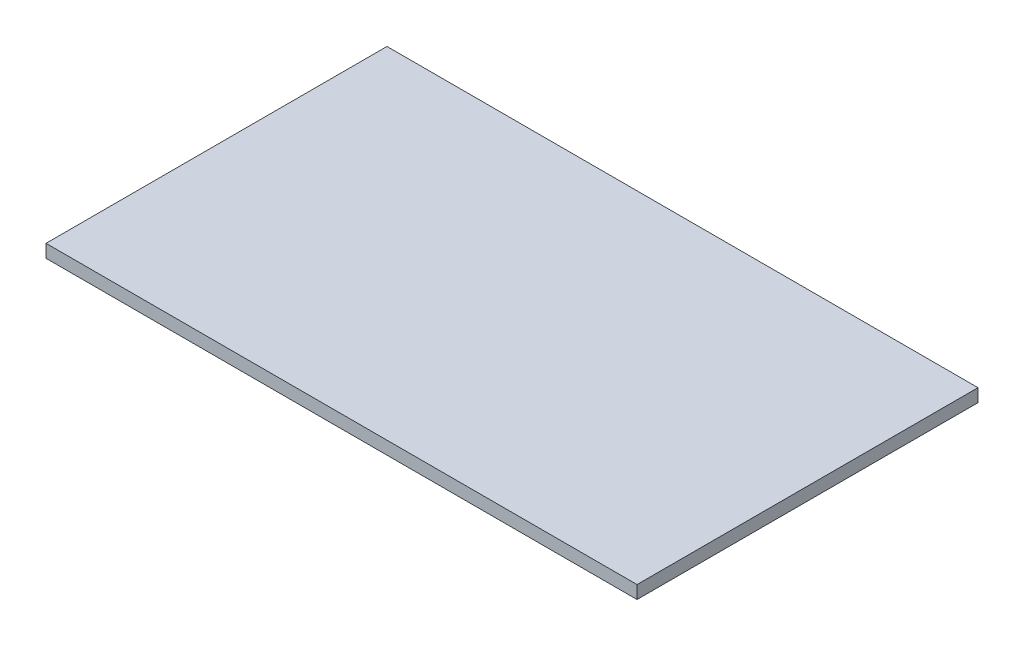
ISO-10303-21;
HEADER;
FILE_DESCRIPTION(('STEP AP214'),'2;1');
FILE_NAME('part.step','',(''),(''),'','','');
FILE_SCHEMA(('AUTOMOTIVE_DESIGN { 1 0 10303 214 1 1 1 1 }'));
ENDSEC;
DATA;
#1=APPLICATION_CONTEXT('core data for automotive mechanical design processes');
#2=APPLICATION_PROTOCOL_DEFINITION('international standard','automotive_design',2000,#1);
#3=PRODUCT_CONTEXT('',#1,'mechanical');
#4=PRODUCT('Part','Part','',(#3));
#5=PRODUCT_RELATED_PRODUCT_CATEGORY('part','',(#4));
#6=PRODUCT_DEFINITION_FORMATION('','',#4);
#7=PRODUCT_DEFINITION_CONTEXT('part definition',#1,'design');
#8=PRODUCT_DEFINITION('design','',#6,#7);
#9=PRODUCT_DEFINITION_SHAPE('','',#8);
#10=(LENGTH_UNIT() NAMED_UNIT(*) SI_UNIT(.MILLI.,.METRE.));
#11=(NAMED_UNIT(*) PLANE_ANGLE_UNIT() SI_UNIT($,.RADIAN.));
#12=(NAMED_UNIT(*) SI_UNIT($,.STERADIAN.) SOLID_ANGLE_UNIT());
#13=UNCERTAINTY_MEASURE_WITH_UNIT(LENGTH_MEASURE(1.E-05),#10,'distance_accuracy_value','');
#14=(GEOMETRIC_REPRESENTATION_CONTEXT(3) GLOBAL_UNCERTAINTY_ASSIGNED_CONTEXT((#13)) GLOBAL_UNIT_ASSIGNED_CONTEXT((#10,
#11,#12)) REPRESENTATION_CONTEXT('',''));
#15=CARTESIAN_POINT('',(0.,0.,0.));
#16=DIRECTION('',(0.,0.,1.));
#17=DIRECTION('',(1.,0.,0.));
#18=AXIS2_PLACEMENT_3D('',#15,#16,#17);
#19=CARTESIAN_POINT('',(0.,5.715,0.));
#20=DIRECTION('',(1.,0.,0.));
#21=DIRECTION('',(0.,0.,-1.));
#22=AXIS2_PLACEMENT_3D('',#19,#20,#21);
#23=PLANE('',#22);
#24=DIRECTION('',(0.,0.,1.));
#25=VECTOR('',#24,1.);
#26=CARTESIAN_POINT('',(0.,0.,0.));
#27=LINE('',#26,#25);
#28=CARTESIAN_POINT('',(0.,0.,-150.));
#29=VERTEX_POINT('',#28);
#30=CARTESIAN_POINT('',(0.,0.,0.));
#31=VERTEX_POINT('',#30);
#32=EDGE_CURVE('E97',#29,#31,#27,.T.);
#33=ORIENTED_EDGE('',*,*,#32,.T.);
#34=DIRECTION('',(0.,-1.,0.));
#35=VECTOR('',#34,1.);
#36=CARTESIAN_POINT('',(0.,5.715,0.));
#37=LINE('',#36,#35);
#38=CARTESIAN_POINT('',(0.,5.715,0.));
#39=VERTEX_POINT('',#38);
#40=EDGE_CURVE('E11',#39,#31,#37,.T.);
#41=ORIENTED_EDGE('',*,*,#40,.F.);
#42=DIRECTION('',(0.,0.,1.));
#43=VECTOR('',#42,1.);
#44=CARTESIAN_POINT('',(0.,5.715,0.));
#45=LINE('',#44,#43);
#46=CARTESIAN_POINT('',(0.,5.715,-150.));
#47=VERTEX_POINT('',#46);
#48=EDGE_CURVE('E85',#47,#39,#45,.T.);
#49=ORIENTED_EDGE('',*,*,#48,.F.);
#50=DIRECTION('',(0.,-1.,0.));
#51=VECTOR('',#50,1.);
#52=CARTESIAN_POINT('',(0.,5.715,-150.));
#53=LINE('',#52,#51);
#54=EDGE_CURVE('E93',#47,#29,#53,.T.);
#55=ORIENTED_EDGE('',*,*,#54,.T.);
#56=EDGE_LOOP('',(#33,#41,#49,#55));
#57=FACE_BOUND('',#56,.T.);
#58=ADVANCED_FACE('F34',(#57),#23,.F.);
#59=CARTESIAN_POINT('',(0.,5.715,0.));
#60=DIRECTION('',(0.,0.,-1.));
#61=DIRECTION('',(-1.,0.,0.));
#62=AXIS2_PLACEMENT_3D('',#59,#60,#61);
#63=PLANE('',#62);
#64=DIRECTION('',(1.,0.,0.));
#65=VECTOR('',#64,1.);
#66=CARTESIAN_POINT('',(0.,0.,0.));
#67=LINE('',#66,#65);
#68=CARTESIAN_POINT('',(260.,0.,0.));
#69=VERTEX_POINT('',#68);
#70=EDGE_CURVE('E89',#31,#69,#67,.T.);
#71=ORIENTED_EDGE('',*,*,#70,.T.);
#72=DIRECTION('',(0.,-1.,0.));
#73=VECTOR('',#72,1.);
#74=CARTESIAN_POINT('',(260.,5.715,0.));
#75=LINE('',#74,#73);
#76=CARTESIAN_POINT('',(260.,5.715,0.));
#77=VERTEX_POINT('',#76);
#78=EDGE_CURVE('E42',#77,#69,#75,.T.);
#79=ORIENTED_EDGE('',*,*,#78,.F.);
#80=DIRECTION('',(1.,0.,0.));
#81=VECTOR('',#80,1.);
#82=CARTESIAN_POINT('',(0.,5.715,0.));
#83=LINE('',#82,#81);
#84=EDGE_CURVE('E80',#39,#77,#83,.T.);
#85=ORIENTED_EDGE('',*,*,#84,.F.);
#86=ORIENTED_EDGE('',*,*,#40,.T.);
#87=EDGE_LOOP('',(#71,#79,#85,#86));
#88=FACE_BOUND('',#87,.T.);
#89=ADVANCED_FACE('F88',(#88),#63,.F.);
#90=CARTESIAN_POINT('',(260.,5.715,0.));
#91=DIRECTION('',(-1.,0.,0.));
#92=DIRECTION('',(0.,0.,1.));
#93=AXIS2_PLACEMENT_3D('',#90,#91,#92);
#94=PLANE('',#93);
#95=DIRECTION('',(0.,0.,-1.));
#96=VECTOR('',#95,1.);
#97=CARTESIAN_POINT('',(260.,0.,0.));
#98=LINE('',#97,#96);
#99=CARTESIAN_POINT('',(260.,0.,-150.));
#100=VERTEX_POINT('',#99);
#101=EDGE_CURVE('E67',#69,#100,#98,.T.);
#102=ORIENTED_EDGE('',*,*,#101,.T.);
#103=DIRECTION('',(0.,-1.,0.));
#104=VECTOR('',#103,1.);
#105=CARTESIAN_POINT('',(260.,5.715,-150.));
#106=LINE('',#105,#104);
#107=CARTESIAN_POINT('',(260.,5.715,-150.));
#108=VERTEX_POINT('',#107);
#109=EDGE_CURVE('E90',#108,#100,#106,.T.);
#110=ORIENTED_EDGE('',*,*,#109,.F.);
#111=DIRECTION('',(0.,0.,-1.));
#112=VECTOR('',#111,1.);
#113=CARTESIAN_POINT('',(260.,5.715,0.));
#114=LINE('',#113,#112);
#115=EDGE_CURVE('E83',#77,#108,#114,.T.);
#116=ORIENTED_EDGE('',*,*,#115,.F.);
#117=ORIENTED_EDGE('',*,*,#78,.T.);
#118=EDGE_LOOP('',(#102,#110,#116,#117));
#119=FACE_BOUND('',#118,.T.);
#120=ADVANCED_FACE('F91',(#119),#94,.F.);
#121=CARTESIAN_POINT('',(0.,5.715,-150.));
#122=DIRECTION('',(0.,0.,1.));
#123=DIRECTION('',(1.,0.,0.));
#124=AXIS2_PLACEMENT_3D('',#121,#122,#123);
#125=PLANE('',#124);
#126=DIRECTION('',(-1.,0.,0.));
#127=VECTOR('',#126,1.);
#128=CARTESIAN_POINT('',(0.,0.,-150.));
#129=LINE('',#128,#127);
#130=EDGE_CURVE('E73',#100,#29,#129,.T.);
#131=ORIENTED_EDGE('',*,*,#130,.T.);
#132=ORIENTED_EDGE('',*,*,#54,.F.);
#133=DIRECTION('',(-1.,0.,0.));
#134=VECTOR('',#133,1.);
#135=CARTESIAN_POINT('',(0.,5.715,-150.));
#136=LINE('',#135,#134);
#137=EDGE_CURVE('E50',#108,#47,#136,.T.);
#138=ORIENTED_EDGE('',*,*,#137,.F.);
#139=ORIENTED_EDGE('',*,*,#109,.T.);
#140=EDGE_LOOP('',(#131,#132,#138,#139));
#141=FACE_BOUND('',#140,.T.);
#142=ADVANCED_FACE('F104',(#141),#125,.F.);
#143=CARTESIAN_POINT('',(0.,5.715,0.));
#144=DIRECTION('',(0.,-1.,0.));
#145=DIRECTION('',(0.,0.,-1.));
#146=AXIS2_PLACEMENT_3D('',#143,#144,#145);
#147=PLANE('',#146);
#148=ORIENTED_EDGE('',*,*,#48,.T.);
#149=ORIENTED_EDGE('',*,*,#84,.T.);
#150=ORIENTED_EDGE('',*,*,#115,.T.);
#151=ORIENTED_EDGE('',*,*,#137,.T.);
#152=EDGE_LOOP('',(#148,#149,#150,#151));
#153=FACE_BOUND('',#152,.T.);
#154=ADVANCED_FACE('F81',(#153),#147,.F.);
#155=CARTESIAN_POINT('',(0.,0.,0.));
#156=DIRECTION('',(0.,-1.,0.));
#157=DIRECTION('',(0.,0.,-1.));
#158=AXIS2_PLACEMENT_3D('',#155,#156,#157);
#159=PLANE('',#158);
#160=ORIENTED_EDGE('',*,*,#32,.F.);
#161=ORIENTED_EDGE('',*,*,#130,.F.);
#162=ORIENTED_EDGE('',*,*,#101,.F.);
#163=ORIENTED_EDGE('',*,*,#70,.F.);
#164=EDGE_LOOP('',(#160,#161,#162,#163));
#165=FACE_BOUND('',#164,.T.);
#166=ADVANCED_FACE('F107',(#165),#159,.T.);
#167=CLOSED_SHELL('',(#58,#89,#120,#142,#154,#166));
#168=MANIFOLD_SOLID_BREP('B2',#167);
#169=ADVANCED_BREP_SHAPE_REPRESENTATION('',(#18,#168),#14);
#170=SHAPE_DEFINITION_REPRESENTATION(#9,#169);
ENDSEC;
END-ISO-10303-21;
